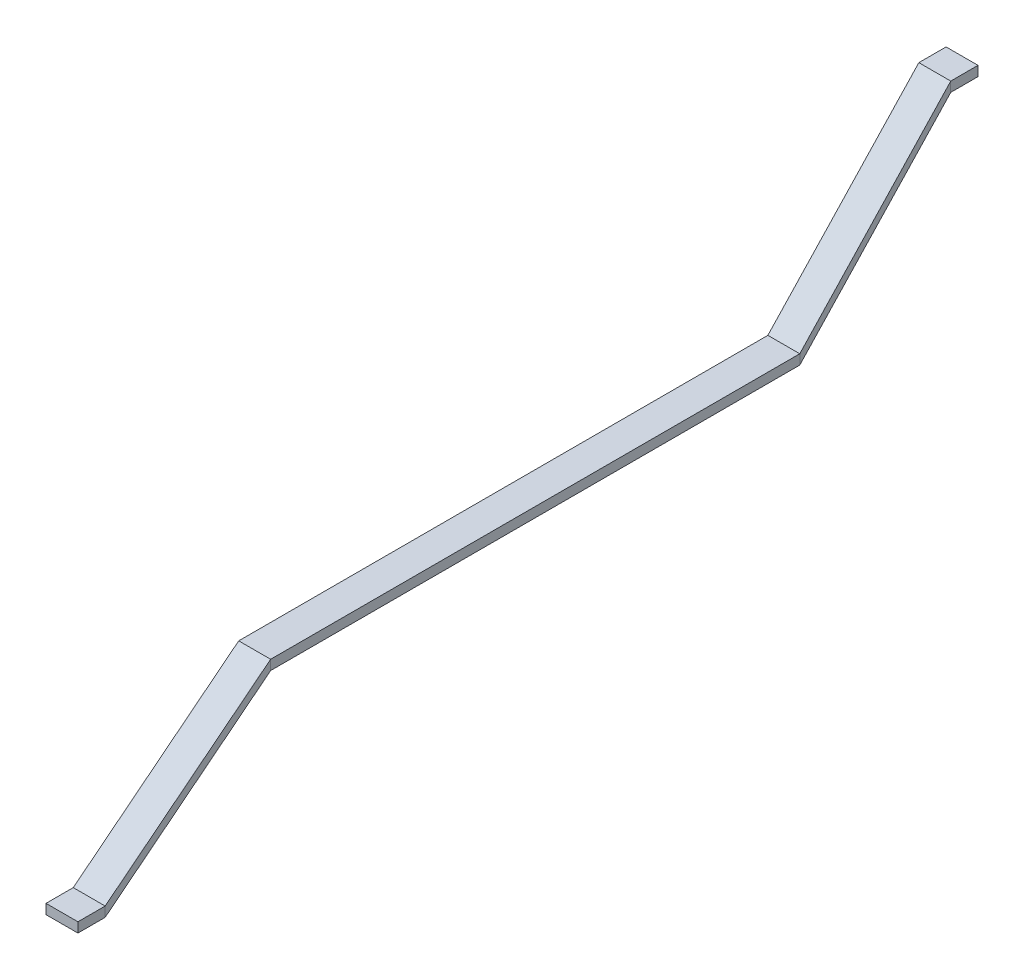
ISO-10303-21;
HEADER;
FILE_DESCRIPTION(('STEP AP214'),'2;1');
FILE_NAME('part.step','',(''),(''),'','','');
FILE_SCHEMA(('AUTOMOTIVE_DESIGN { 1 0 10303 214 1 1 1 1 }'));
ENDSEC;
DATA;
#1=APPLICATION_CONTEXT('core data for automotive mechanical design processes');
#2=APPLICATION_PROTOCOL_DEFINITION('international standard','automotive_design',2000,#1);
#3=PRODUCT_CONTEXT('',#1,'mechanical');
#4=PRODUCT('Part','Part','',(#3));
#5=PRODUCT_RELATED_PRODUCT_CATEGORY('part','',(#4));
#6=PRODUCT_DEFINITION_FORMATION('','',#4);
#7=PRODUCT_DEFINITION_CONTEXT('part definition',#1,'design');
#8=PRODUCT_DEFINITION('design','',#6,#7);
#9=PRODUCT_DEFINITION_SHAPE('','',#8);
#10=(LENGTH_UNIT() NAMED_UNIT(*) SI_UNIT(.MILLI.,.METRE.));
#11=(NAMED_UNIT(*) PLANE_ANGLE_UNIT() SI_UNIT($,.RADIAN.));
#12=(NAMED_UNIT(*) SI_UNIT($,.STERADIAN.) SOLID_ANGLE_UNIT());
#13=UNCERTAINTY_MEASURE_WITH_UNIT(LENGTH_MEASURE(1.E-05),#10,'distance_accuracy_value','');
#14=(GEOMETRIC_REPRESENTATION_CONTEXT(3) GLOBAL_UNCERTAINTY_ASSIGNED_CONTEXT((#13)) GLOBAL_UNIT_ASSIGNED_CONTEXT((#10,
#11,#12)) REPRESENTATION_CONTEXT('',''));
#15=CARTESIAN_POINT('',(0.,0.,0.));
#16=DIRECTION('',(0.,0.,1.));
#17=DIRECTION('',(1.,0.,0.));
#18=AXIS2_PLACEMENT_3D('',#15,#16,#17);
#19=CARTESIAN_POINT('',(0.,0.,-410.));
#20=DIRECTION('',(0.,0.,1.));
#21=DIRECTION('',(1.,0.,0.));
#22=AXIS2_PLACEMENT_3D('',#19,#20,#21);
#23=PLANE('',#22);
#24=DIRECTION('',(0.,-1.,0.));
#25=VECTOR('',#24,1.);
#26=CARTESIAN_POINT('',(3162.93419588837,346.929566118212,-410.));
#27=LINE('',#26,#25);
#28=CARTESIAN_POINT('',(3162.93419588837,346.929566118212,-410.));
#29=VERTEX_POINT('',#28);
#30=CARTESIAN_POINT('',(3162.93419588837,325.329566118212,-410.));
#31=VERTEX_POINT('',#30);
#32=EDGE_CURVE('E128',#29,#31,#27,.T.);
#33=ORIENTED_EDGE('',*,*,#32,.F.);
#34=DIRECTION('',(-1.,0.,0.));
#35=VECTOR('',#34,1.);
#36=CARTESIAN_POINT('',(3162.93419588837,346.929566118212,-410.));
#37=LINE('',#36,#35);
#38=CARTESIAN_POINT('',(3233.18419588837,346.929566118212,-410.));
#39=VERTEX_POINT('',#38);
#40=EDGE_CURVE('E40',#39,#29,#37,.T.);
#41=ORIENTED_EDGE('',*,*,#40,.F.);
#42=DIRECTION('',(0.,1.,0.));
#43=VECTOR('',#42,1.);
#44=CARTESIAN_POINT('',(3233.18419588837,346.929566118212,-410.));
#45=LINE('',#44,#43);
#46=CARTESIAN_POINT('',(3233.18419588837,325.329566118212,-410.));
#47=VERTEX_POINT('',#46);
#48=EDGE_CURVE('E117',#47,#39,#45,.T.);
#49=ORIENTED_EDGE('',*,*,#48,.F.);
#50=DIRECTION('',(1.,0.,0.));
#51=VECTOR('',#50,1.);
#52=CARTESIAN_POINT('',(3162.93419588837,325.329566118212,-410.));
#53=LINE('',#52,#51);
#54=EDGE_CURVE('E111',#31,#47,#53,.T.);
#55=ORIENTED_EDGE('',*,*,#54,.F.);
#56=EDGE_LOOP('',(#33,#41,#49,#55));
#57=FACE_BOUND('',#56,.T.);
#58=ADVANCED_FACE('F37',(#57),#23,.F.);
#59=CARTESIAN_POINT('',(3.34452463663659,-638.751316548725,1575.));
#60=DIRECTION('',(0.,0.,1.));
#61=DIRECTION('',(1.,0.,0.));
#62=AXIS2_PLACEMENT_3D('',#59,#60,#61);
#63=PLANE('',#62);
#64=DIRECTION('',(0.,-1.,0.));
#65=VECTOR('',#64,1.);
#66=CARTESIAN_POINT('',(3166.27872052501,-291.821750430513,1575.));
#67=LINE('',#66,#65);
#68=CARTESIAN_POINT('',(3166.27872052501,-291.821750430513,1575.));
#69=VERTEX_POINT('',#68);
#70=CARTESIAN_POINT('',(3166.27872052501,-313.421750430513,1575.));
#71=VERTEX_POINT('',#70);
#72=EDGE_CURVE('E184',#69,#71,#67,.T.);
#73=ORIENTED_EDGE('',*,*,#72,.T.);
#74=DIRECTION('',(1.,0.,0.));
#75=VECTOR('',#74,1.);
#76=CARTESIAN_POINT('',(3166.27872052501,-313.421750430513,1575.));
#77=LINE('',#76,#75);
#78=CARTESIAN_POINT('',(3236.52872052501,-313.421750430513,1575.));
#79=VERTEX_POINT('',#78);
#80=EDGE_CURVE('E213',#71,#79,#77,.T.);
#81=ORIENTED_EDGE('',*,*,#80,.T.);
#82=DIRECTION('',(0.,1.,0.));
#83=VECTOR('',#82,1.);
#84=CARTESIAN_POINT('',(3236.52872052501,-291.821750430513,1575.));
#85=LINE('',#84,#83);
#86=CARTESIAN_POINT('',(3236.52872052501,-291.821750430513,1575.));
#87=VERTEX_POINT('',#86);
#88=EDGE_CURVE('E206',#79,#87,#85,.T.);
#89=ORIENTED_EDGE('',*,*,#88,.T.);
#90=DIRECTION('',(-1.,0.,0.));
#91=VECTOR('',#90,1.);
#92=CARTESIAN_POINT('',(3166.27872052501,-291.821750430513,1575.));
#93=LINE('',#92,#91);
#94=EDGE_CURVE('E202',#87,#69,#93,.T.);
#95=ORIENTED_EDGE('',*,*,#94,.T.);
#96=EDGE_LOOP('',(#73,#81,#89,#95));
#97=FACE_BOUND('',#96,.T.);
#98=ADVANCED_FACE('F232',(#97),#63,.T.);
#99=CARTESIAN_POINT('',(3162.93419588837,346.929566118212,-350.));
#100=DIRECTION('',(1.,0.,0.));
#101=DIRECTION('',(0.,0.,-1.));
#102=AXIS2_PLACEMENT_3D('',#99,#100,#101);
#103=PLANE('',#102);
#104=DIRECTION('',(0.,0.,-1.));
#105=VECTOR('',#104,1.);
#106=CARTESIAN_POINT('',(3162.93419588837,325.329566118212,-350.));
#107=LINE('',#106,#105);
#108=CARTESIAN_POINT('',(3162.93419588837,325.329566118212,-350.));
#109=VERTEX_POINT('',#108);
#110=EDGE_CURVE('E139',#109,#31,#107,.T.);
#111=ORIENTED_EDGE('',*,*,#110,.F.);
#112=DIRECTION('',(0.,-1.,0.));
#113=VECTOR('',#112,1.);
#114=CARTESIAN_POINT('',(3162.93419588837,346.929566118212,-350.));
#115=LINE('',#114,#113);
#116=CARTESIAN_POINT('',(3162.93419588837,346.929566118212,-350.));
#117=VERTEX_POINT('',#116);
#118=EDGE_CURVE('E158',#117,#109,#115,.T.);
#119=ORIENTED_EDGE('',*,*,#118,.F.);
#120=DIRECTION('',(0.,0.,-1.));
#121=VECTOR('',#120,1.);
#122=CARTESIAN_POINT('',(3162.93419588837,346.929566118212,-350.));
#123=LINE('',#122,#121);
#124=EDGE_CURVE('E140',#117,#29,#123,.T.);
#125=ORIENTED_EDGE('',*,*,#124,.T.);
#126=ORIENTED_EDGE('',*,*,#32,.T.);
#127=EDGE_LOOP('',(#111,#119,#125,#126));
#128=FACE_BOUND('',#127,.T.);
#129=ADVANCED_FACE('F313',(#128),#103,.F.);
#130=CARTESIAN_POINT('',(3162.93419588837,325.329566118212,-350.));
#131=DIRECTION('',(0.,1.,0.));
#132=DIRECTION('',(0.,0.,1.));
#133=AXIS2_PLACEMENT_3D('',#130,#131,#132);
#134=PLANE('',#133);
#135=DIRECTION('',(0.,0.,-1.));
#136=VECTOR('',#135,1.);
#137=CARTESIAN_POINT('',(3233.18419588837,325.329566118212,-350.));
#138=LINE('',#137,#136);
#139=CARTESIAN_POINT('',(3233.18419588837,325.329566118212,-350.));
#140=VERTEX_POINT('',#139);
#141=EDGE_CURVE('E124',#140,#47,#138,.T.);
#142=ORIENTED_EDGE('',*,*,#141,.F.);
#143=DIRECTION('',(1.,0.,0.));
#144=VECTOR('',#143,1.);
#145=CARTESIAN_POINT('',(3162.93419588837,325.329566118212,-350.));
#146=LINE('',#145,#144);
#147=EDGE_CURVE('E153',#109,#140,#146,.T.);
#148=ORIENTED_EDGE('',*,*,#147,.F.);
#149=ORIENTED_EDGE('',*,*,#110,.T.);
#150=ORIENTED_EDGE('',*,*,#54,.T.);
#151=EDGE_LOOP('',(#142,#148,#149,#150));
#152=FACE_BOUND('',#151,.T.);
#153=ADVANCED_FACE('F316',(#152),#134,.F.);
#154=CARTESIAN_POINT('',(3233.18419588837,346.929566118212,-350.));
#155=DIRECTION('',(-1.,0.,0.));
#156=DIRECTION('',(0.,0.,1.));
#157=AXIS2_PLACEMENT_3D('',#154,#155,#156);
#158=PLANE('',#157);
#159=DIRECTION('',(0.,0.,-1.));
#160=VECTOR('',#159,1.);
#161=CARTESIAN_POINT('',(3233.18419588837,346.929566118212,-350.));
#162=LINE('',#161,#160);
#163=CARTESIAN_POINT('',(3233.18419588837,346.929566118212,-350.));
#164=VERTEX_POINT('',#163);
#165=EDGE_CURVE('E122',#164,#39,#162,.T.);
#166=ORIENTED_EDGE('',*,*,#165,.F.);
#167=DIRECTION('',(0.,1.,0.));
#168=VECTOR('',#167,1.);
#169=CARTESIAN_POINT('',(3233.18419588837,346.929566118212,-350.));
#170=LINE('',#169,#168);
#171=EDGE_CURVE('E148',#140,#164,#170,.T.);
#172=ORIENTED_EDGE('',*,*,#171,.F.);
#173=ORIENTED_EDGE('',*,*,#141,.T.);
#174=ORIENTED_EDGE('',*,*,#48,.T.);
#175=EDGE_LOOP('',(#166,#172,#173,#174));
#176=FACE_BOUND('',#175,.T.);
#177=ADVANCED_FACE('F119',(#176),#158,.F.);
#178=CARTESIAN_POINT('',(3162.93419588837,346.929566118212,-350.));
#179=DIRECTION('',(0.,-1.,0.));
#180=DIRECTION('',(0.,0.,-1.));
#181=AXIS2_PLACEMENT_3D('',#178,#179,#180);
#182=PLANE('',#181);
#183=ORIENTED_EDGE('',*,*,#40,.T.);
#184=ORIENTED_EDGE('',*,*,#124,.F.);
#185=DIRECTION('',(-1.,0.,0.));
#186=VECTOR('',#185,1.);
#187=CARTESIAN_POINT('',(3162.93419588837,346.929566118212,-350.));
#188=LINE('',#187,#186);
#189=EDGE_CURVE('E134',#164,#117,#188,.T.);
#190=ORIENTED_EDGE('',*,*,#189,.F.);
#191=ORIENTED_EDGE('',*,*,#165,.T.);
#192=EDGE_LOOP('',(#183,#184,#190,#191));
#193=FACE_BOUND('',#192,.T.);
#194=ADVANCED_FACE('F133',(#193),#182,.F.);
#195=CARTESIAN_POINT('',(3180.55,10.7999999999999,4.9960036108132E-13));
#196=DIRECTION('',(0.998735803156119,0.,-0.0502672407647662));
#197=DIRECTION('',(-0.0502672407647662,0.,-0.998735803156119));
#198=AXIS2_PLACEMENT_3D('',#195,#196,#197);
#199=PLANE('',#198);
#200=DIRECTION('',(-0.0362774413178976,0.692214816467807,-0.72077915835148));
#201=VECTOR('',#200,1.);
#202=CARTESIAN_POINT('',(3180.55,-10.8,4.9960036108132E-13));
#203=LINE('',#202,#201);
#204=CARTESIAN_POINT('',(3180.55,-10.8,4.71844785465692E-13));
#205=VERTEX_POINT('',#204);
#206=EDGE_CURVE('E155',#205,#109,#203,.T.);
#207=ORIENTED_EDGE('',*,*,#206,.F.);
#208=DIRECTION('',(0.,-1.,0.));
#209=VECTOR('',#208,1.);
#210=CARTESIAN_POINT('',(3180.55,10.7999999999999,4.9960036108132E-13));
#211=LINE('',#210,#209);
#212=CARTESIAN_POINT('',(3180.55,10.7999999999999,4.71844785465692E-13));
#213=VERTEX_POINT('',#212);
#214=EDGE_CURVE('E178',#213,#205,#211,.T.);
#215=ORIENTED_EDGE('',*,*,#214,.F.);
#216=DIRECTION('',(-0.0362774413178976,0.692214816467807,-0.72077915835148));
#217=VECTOR('',#216,1.);
#218=CARTESIAN_POINT('',(3180.55,10.7999999999999,4.9960036108132E-13));
#219=LINE('',#218,#217);
#220=EDGE_CURVE('E132',#213,#117,#219,.T.);
#221=ORIENTED_EDGE('',*,*,#220,.T.);
#222=ORIENTED_EDGE('',*,*,#118,.T.);
#223=EDGE_LOOP('',(#207,#215,#221,#222));
#224=FACE_BOUND('',#223,.T.);
#225=ADVANCED_FACE('F298',(#224),#199,.F.);
#226=CARTESIAN_POINT('',(3180.55,-10.8,4.9960036108132E-13));
#227=DIRECTION('',(0.,0.72125391870639,0.692670762159539));
#228=DIRECTION('',(0.,-0.692670762159539,0.72125391870639));
#229=AXIS2_PLACEMENT_3D('',#226,#227,#228);
#230=PLANE('',#229);
#231=DIRECTION('',(-0.0362774413178976,0.692214816467807,-0.72077915835148));
#232=VECTOR('',#231,1.);
#233=CARTESIAN_POINT('',(3250.8,-10.8,4.9960036108132E-13));
#234=LINE('',#233,#232);
#235=CARTESIAN_POINT('',(3250.8,-10.8,4.71844785465692E-13));
#236=VERTEX_POINT('',#235);
#237=EDGE_CURVE('E150',#236,#140,#234,.T.);
#238=ORIENTED_EDGE('',*,*,#237,.F.);
#239=DIRECTION('',(1.,0.,0.));
#240=VECTOR('',#239,1.);
#241=CARTESIAN_POINT('',(3180.55,-10.8,4.9960036108132E-13));
#242=LINE('',#241,#240);
#243=EDGE_CURVE('E173',#205,#236,#242,.T.);
#244=ORIENTED_EDGE('',*,*,#243,.F.);
#245=ORIENTED_EDGE('',*,*,#206,.T.);
#246=ORIENTED_EDGE('',*,*,#147,.T.);
#247=EDGE_LOOP('',(#238,#244,#245,#246));
#248=FACE_BOUND('',#247,.T.);
#249=ADVANCED_FACE('F301',(#248),#230,.F.);
#250=CARTESIAN_POINT('',(3250.8,10.7999999999999,4.9960036108132E-13));
#251=DIRECTION('',(-0.998735803156119,0.,0.0502672407647662));
#252=DIRECTION('',(0.0502672407647662,0.,0.998735803156119));
#253=AXIS2_PLACEMENT_3D('',#250,#251,#252);
#254=PLANE('',#253);
#255=DIRECTION('',(-0.0362774413178976,0.692214816467807,-0.72077915835148));
#256=VECTOR('',#255,1.);
#257=CARTESIAN_POINT('',(3250.8,10.7999999999999,4.9960036108132E-13));
#258=LINE('',#257,#256);
#259=CARTESIAN_POINT('',(3250.8,10.7999999999999,4.71844785465692E-13));
#260=VERTEX_POINT('',#259);
#261=EDGE_CURVE('E146',#260,#164,#258,.T.);
#262=ORIENTED_EDGE('',*,*,#261,.F.);
#263=DIRECTION('',(0.,1.,0.));
#264=VECTOR('',#263,1.);
#265=CARTESIAN_POINT('',(3250.8,10.7999999999999,4.9960036108132E-13));
#266=LINE('',#265,#264);
#267=EDGE_CURVE('E168',#236,#260,#266,.T.);
#268=ORIENTED_EDGE('',*,*,#267,.F.);
#269=ORIENTED_EDGE('',*,*,#237,.T.);
#270=ORIENTED_EDGE('',*,*,#171,.T.);
#271=EDGE_LOOP('',(#262,#268,#269,#270));
#272=FACE_BOUND('',#271,.T.);
#273=ADVANCED_FACE('F305',(#272),#254,.F.);
#274=CARTESIAN_POINT('',(3180.55,10.7999999999999,4.9960036108132E-13));
#275=DIRECTION('',(0.,-0.72125391870639,-0.692670762159539));
#276=DIRECTION('',(0.,0.692670762159539,-0.72125391870639));
#277=AXIS2_PLACEMENT_3D('',#274,#275,#276);
#278=PLANE('',#277);
#279=ORIENTED_EDGE('',*,*,#189,.T.);
#280=ORIENTED_EDGE('',*,*,#220,.F.);
#281=DIRECTION('',(-1.,0.,0.));
#282=VECTOR('',#281,1.);
#283=CARTESIAN_POINT('',(3180.55,10.7999999999999,4.9960036108132E-13));
#284=LINE('',#283,#282);
#285=EDGE_CURVE('E162',#260,#213,#284,.T.);
#286=ORIENTED_EDGE('',*,*,#285,.F.);
#287=ORIENTED_EDGE('',*,*,#261,.T.);
#288=EDGE_LOOP('',(#279,#280,#286,#287));
#289=FACE_BOUND('',#288,.T.);
#290=ADVANCED_FACE('F286',(#289),#278,.F.);
#291=CARTESIAN_POINT('',(3180.55,10.7999999999999,1165.));
#292=DIRECTION('',(1.,0.,0.));
#293=DIRECTION('',(0.,0.,-1.));
#294=AXIS2_PLACEMENT_3D('',#291,#292,#293);
#295=PLANE('',#294);
#296=DIRECTION('',(0.,0.,-1.));
#297=VECTOR('',#296,1.);
#298=CARTESIAN_POINT('',(3180.55,-10.8,1165.));
#299=LINE('',#298,#297);
#300=CARTESIAN_POINT('',(3180.55,-10.8000000000001,1165.));
#301=VERTEX_POINT('',#300);
#302=EDGE_CURVE('E175',#301,#205,#299,.T.);
#303=ORIENTED_EDGE('',*,*,#302,.F.);
#304=DIRECTION('',(0.,-1.,0.));
#305=VECTOR('',#304,1.);
#306=CARTESIAN_POINT('',(3180.55,10.7999999999999,1165.));
#307=LINE('',#306,#305);
#308=CARTESIAN_POINT('',(3180.55,10.7999999999999,1165.));
#309=VERTEX_POINT('',#308);
#310=EDGE_CURVE('E198',#309,#301,#307,.T.);
#311=ORIENTED_EDGE('',*,*,#310,.F.);
#312=DIRECTION('',(0.,0.,-1.));
#313=VECTOR('',#312,1.);
#314=CARTESIAN_POINT('',(3180.55,10.7999999999999,1165.));
#315=LINE('',#314,#313);
#316=EDGE_CURVE('E145',#309,#213,#315,.T.);
#317=ORIENTED_EDGE('',*,*,#316,.T.);
#318=ORIENTED_EDGE('',*,*,#214,.T.);
#319=EDGE_LOOP('',(#303,#311,#317,#318));
#320=FACE_BOUND('',#319,.T.);
#321=ADVANCED_FACE('F282',(#320),#295,.F.);
#322=CARTESIAN_POINT('',(3180.55,-10.8,1165.));
#323=DIRECTION('',(0.,1.,0.));
#324=DIRECTION('',(0.,0.,1.));
#325=AXIS2_PLACEMENT_3D('',#322,#323,#324);
#326=PLANE('',#325);
#327=DIRECTION('',(0.,0.,-1.));
#328=VECTOR('',#327,1.);
#329=CARTESIAN_POINT('',(3250.8,-10.8,1165.));
#330=LINE('',#329,#328);
#331=CARTESIAN_POINT('',(3250.8,-10.8000000000001,1165.));
#332=VERTEX_POINT('',#331);
#333=EDGE_CURVE('E170',#332,#236,#330,.T.);
#334=ORIENTED_EDGE('',*,*,#333,.F.);
#335=DIRECTION('',(1.,0.,0.));
#336=VECTOR('',#335,1.);
#337=CARTESIAN_POINT('',(3180.55,-10.8,1165.));
#338=LINE('',#337,#336);
#339=EDGE_CURVE('E193',#301,#332,#338,.T.);
#340=ORIENTED_EDGE('',*,*,#339,.F.);
#341=ORIENTED_EDGE('',*,*,#302,.T.);
#342=ORIENTED_EDGE('',*,*,#243,.T.);
#343=EDGE_LOOP('',(#334,#340,#341,#342));
#344=FACE_BOUND('',#343,.T.);
#345=ADVANCED_FACE('F285',(#344),#326,.F.);
#346=CARTESIAN_POINT('',(3250.8,10.7999999999999,1165.));
#347=DIRECTION('',(-1.,0.,0.));
#348=DIRECTION('',(0.,0.,1.));
#349=AXIS2_PLACEMENT_3D('',#346,#347,#348);
#350=PLANE('',#349);
#351=DIRECTION('',(0.,0.,-1.));
#352=VECTOR('',#351,1.);
#353=CARTESIAN_POINT('',(3250.8,10.7999999999999,1165.));
#354=LINE('',#353,#352);
#355=CARTESIAN_POINT('',(3250.8,10.7999999999999,1165.));
#356=VERTEX_POINT('',#355);
#357=EDGE_CURVE('E165',#356,#260,#354,.T.);
#358=ORIENTED_EDGE('',*,*,#357,.F.);
#359=DIRECTION('',(0.,1.,0.));
#360=VECTOR('',#359,1.);
#361=CARTESIAN_POINT('',(3250.8,10.7999999999999,1165.));
#362=LINE('',#361,#360);
#363=EDGE_CURVE('E188',#332,#356,#362,.T.);
#364=ORIENTED_EDGE('',*,*,#363,.F.);
#365=ORIENTED_EDGE('',*,*,#333,.T.);
#366=ORIENTED_EDGE('',*,*,#267,.T.);
#367=EDGE_LOOP('',(#358,#364,#365,#366));
#368=FACE_BOUND('',#367,.T.);
#369=ADVANCED_FACE('F290',(#368),#350,.F.);
#370=CARTESIAN_POINT('',(3180.55,10.7999999999999,1165.));
#371=DIRECTION('',(0.,-1.,0.));
#372=DIRECTION('',(0.,0.,-1.));
#373=AXIS2_PLACEMENT_3D('',#370,#371,#372);
#374=PLANE('',#373);
#375=ORIENTED_EDGE('',*,*,#285,.T.);
#376=ORIENTED_EDGE('',*,*,#316,.F.);
#377=DIRECTION('',(-1.,0.,0.));
#378=VECTOR('',#377,1.);
#379=CARTESIAN_POINT('',(3180.55,10.7999999999999,1165.));
#380=LINE('',#379,#378);
#381=EDGE_CURVE('E182',#356,#309,#380,.T.);
#382=ORIENTED_EDGE('',*,*,#381,.F.);
#383=ORIENTED_EDGE('',*,*,#357,.T.);
#384=EDGE_LOOP('',(#375,#376,#382,#383));
#385=FACE_BOUND('',#384,.T.);
#386=ADVANCED_FACE('F269',(#385),#374,.F.);
#387=CARTESIAN_POINT('',(3166.27872052501,-291.821750430513,1515.));
#388=DIRECTION('',(0.99916973141841,0.,0.040741229942928));
#389=DIRECTION('',(0.040741229942928,0.,-0.99916973141841));
#390=AXIS2_PLACEMENT_3D('',#387,#388,#389);
#391=PLANE('',#390);
#392=DIRECTION('',(0.0308296398160387,0.65374093350359,-0.756090156774089));
#393=VECTOR('',#392,1.);
#394=CARTESIAN_POINT('',(3166.27872052501,-313.421750430513,1515.));
#395=LINE('',#394,#393);
#396=CARTESIAN_POINT('',(3166.27872052501,-313.421750430513,1515.));
#397=VERTEX_POINT('',#396);
#398=EDGE_CURVE('E195',#397,#301,#395,.T.);
#399=ORIENTED_EDGE('',*,*,#398,.F.);
#400=DIRECTION('',(0.,-1.,0.));
#401=VECTOR('',#400,1.);
#402=CARTESIAN_POINT('',(3166.27872052501,-291.821750430513,1515.));
#403=LINE('',#402,#401);
#404=CARTESIAN_POINT('',(3166.27872052501,-291.821750430513,1515.));
#405=VERTEX_POINT('',#404);
#406=EDGE_CURVE('E222',#405,#397,#403,.T.);
#407=ORIENTED_EDGE('',*,*,#406,.F.);
#408=DIRECTION('',(0.0308296398160387,0.65374093350359,-0.756090156774089));
#409=VECTOR('',#408,1.);
#410=CARTESIAN_POINT('',(3166.27872052501,-291.821750430513,1515.));
#411=LINE('',#410,#409);
#412=EDGE_CURVE('E164',#405,#309,#411,.T.);
#413=ORIENTED_EDGE('',*,*,#412,.T.);
#414=ORIENTED_EDGE('',*,*,#310,.T.);
#415=EDGE_LOOP('',(#399,#407,#413,#414));
#416=FACE_BOUND('',#415,.T.);
#417=ADVANCED_FACE('F265',(#416),#391,.F.);
#418=CARTESIAN_POINT('',(3166.27872052501,-313.421750430513,1515.));
#419=DIRECTION('',(0.,0.756449732372647,0.654051834638012));
#420=DIRECTION('',(0.,-0.654051834638013,0.756449732372648));
#421=AXIS2_PLACEMENT_3D('',#418,#419,#420);
#422=PLANE('',#421);
#423=DIRECTION('',(0.0308296398160387,0.65374093350359,-0.756090156774089));
#424=VECTOR('',#423,1.);
#425=CARTESIAN_POINT('',(3236.52872052501,-313.421750430513,1515.));
#426=LINE('',#425,#424);
#427=CARTESIAN_POINT('',(3236.52872052501,-313.421750430513,1515.));
#428=VERTEX_POINT('',#427);
#429=EDGE_CURVE('E190',#428,#332,#426,.T.);
#430=ORIENTED_EDGE('',*,*,#429,.F.);
#431=DIRECTION('',(1.,0.,0.));
#432=VECTOR('',#431,1.);
#433=CARTESIAN_POINT('',(3166.27872052501,-313.421750430513,1515.));
#434=LINE('',#433,#432);
#435=EDGE_CURVE('E215',#397,#428,#434,.T.);
#436=ORIENTED_EDGE('',*,*,#435,.F.);
#437=ORIENTED_EDGE('',*,*,#398,.T.);
#438=ORIENTED_EDGE('',*,*,#339,.T.);
#439=EDGE_LOOP('',(#430,#436,#437,#438));
#440=FACE_BOUND('',#439,.T.);
#441=ADVANCED_FACE('F268',(#440),#422,.F.);
#442=CARTESIAN_POINT('',(3236.52872052501,-291.821750430513,1515.));
#443=DIRECTION('',(-0.99916973141841,0.,-0.040741229942928));
#444=DIRECTION('',(-0.040741229942928,0.,0.99916973141841));
#445=AXIS2_PLACEMENT_3D('',#442,#443,#444);
#446=PLANE('',#445);
#447=DIRECTION('',(0.0308296398160387,0.65374093350359,-0.756090156774089));
#448=VECTOR('',#447,1.);
#449=CARTESIAN_POINT('',(3236.52872052501,-291.821750430513,1515.));
#450=LINE('',#449,#448);
#451=CARTESIAN_POINT('',(3236.52872052501,-291.821750430513,1515.));
#452=VERTEX_POINT('',#451);
#453=EDGE_CURVE('E185',#452,#356,#450,.T.);
#454=ORIENTED_EDGE('',*,*,#453,.F.);
#455=DIRECTION('',(0.,1.,0.));
#456=VECTOR('',#455,1.);
#457=CARTESIAN_POINT('',(3236.52872052501,-291.821750430513,1515.));
#458=LINE('',#457,#456);
#459=EDGE_CURVE('E55',#428,#452,#458,.T.);
#460=ORIENTED_EDGE('',*,*,#459,.F.);
#461=ORIENTED_EDGE('',*,*,#429,.T.);
#462=ORIENTED_EDGE('',*,*,#363,.T.);
#463=EDGE_LOOP('',(#454,#460,#461,#462));
#464=FACE_BOUND('',#463,.T.);
#465=ADVANCED_FACE('F273',(#464),#446,.F.);
#466=CARTESIAN_POINT('',(3166.27872052501,-291.821750430513,1515.));
#467=DIRECTION('',(0.,-0.756449732372647,-0.654051834638012));
#468=DIRECTION('',(0.,0.654051834638013,-0.756449732372648));
#469=AXIS2_PLACEMENT_3D('',#466,#467,#468);
#470=PLANE('',#469);
#471=ORIENTED_EDGE('',*,*,#381,.T.);
#472=ORIENTED_EDGE('',*,*,#412,.F.);
#473=DIRECTION('',(-1.,0.,0.));
#474=VECTOR('',#473,1.);
#475=CARTESIAN_POINT('',(3166.27872052501,-291.821750430513,1515.));
#476=LINE('',#475,#474);
#477=EDGE_CURVE('E11',#452,#405,#476,.T.);
#478=ORIENTED_EDGE('',*,*,#477,.F.);
#479=ORIENTED_EDGE('',*,*,#453,.T.);
#480=EDGE_LOOP('',(#471,#472,#478,#479));
#481=FACE_BOUND('',#480,.T.);
#482=ADVANCED_FACE('F277',(#481),#470,.F.);
#483=CARTESIAN_POINT('',(3166.27872052501,-291.821750430513,1575.));
#484=DIRECTION('',(1.,0.,0.));
#485=DIRECTION('',(0.,0.,-1.));
#486=AXIS2_PLACEMENT_3D('',#483,#484,#485);
#487=PLANE('',#486);
#488=DIRECTION('',(0.,0.,-1.));
#489=VECTOR('',#488,1.);
#490=CARTESIAN_POINT('',(3166.27872052501,-313.421750430513,1575.));
#491=LINE('',#490,#489);
#492=EDGE_CURVE('E217',#71,#397,#491,.T.);
#493=ORIENTED_EDGE('',*,*,#492,.F.);
#494=ORIENTED_EDGE('',*,*,#72,.F.);
#495=DIRECTION('',(0.,0.,-1.));
#496=VECTOR('',#495,1.);
#497=CARTESIAN_POINT('',(3166.27872052501,-291.821750430513,1575.));
#498=LINE('',#497,#496);
#499=EDGE_CURVE('E205',#69,#405,#498,.T.);
#500=ORIENTED_EDGE('',*,*,#499,.T.);
#501=ORIENTED_EDGE('',*,*,#406,.T.);
#502=EDGE_LOOP('',(#493,#494,#500,#501));
#503=FACE_BOUND('',#502,.T.);
#504=ADVANCED_FACE('F240',(#503),#487,.F.);
#505=CARTESIAN_POINT('',(3166.27872052501,-313.421750430513,1575.));
#506=DIRECTION('',(0.,1.,0.));
#507=DIRECTION('',(0.,0.,1.));
#508=AXIS2_PLACEMENT_3D('',#505,#506,#507);
#509=PLANE('',#508);
#510=DIRECTION('',(0.,0.,-1.));
#511=VECTOR('',#510,1.);
#512=CARTESIAN_POINT('',(3236.52872052501,-313.421750430513,1575.));
#513=LINE('',#512,#511);
#514=EDGE_CURVE('E210',#79,#428,#513,.T.);
#515=ORIENTED_EDGE('',*,*,#514,.F.);
#516=ORIENTED_EDGE('',*,*,#80,.F.);
#517=ORIENTED_EDGE('',*,*,#492,.T.);
#518=ORIENTED_EDGE('',*,*,#435,.T.);
#519=EDGE_LOOP('',(#515,#516,#517,#518));
#520=FACE_BOUND('',#519,.T.);
#521=ADVANCED_FACE('F244',(#520),#509,.F.);
#522=CARTESIAN_POINT('',(3236.52872052501,-291.821750430513,1575.));
#523=DIRECTION('',(-1.,0.,0.));
#524=DIRECTION('',(0.,0.,1.));
#525=AXIS2_PLACEMENT_3D('',#522,#523,#524);
#526=PLANE('',#525);
#527=DIRECTION('',(0.,0.,-1.));
#528=VECTOR('',#527,1.);
#529=CARTESIAN_POINT('',(3236.52872052501,-291.821750430513,1575.));
#530=LINE('',#529,#528);
#531=EDGE_CURVE('E46',#87,#452,#530,.T.);
#532=ORIENTED_EDGE('',*,*,#531,.F.);
#533=ORIENTED_EDGE('',*,*,#88,.F.);
#534=ORIENTED_EDGE('',*,*,#514,.T.);
#535=ORIENTED_EDGE('',*,*,#459,.T.);
#536=EDGE_LOOP('',(#532,#533,#534,#535));
#537=FACE_BOUND('',#536,.T.);
#538=ADVANCED_FACE('F254',(#537),#526,.F.);
#539=CARTESIAN_POINT('',(3166.27872052501,-291.821750430513,1575.));
#540=DIRECTION('',(0.,-1.,0.));
#541=DIRECTION('',(0.,0.,-1.));
#542=AXIS2_PLACEMENT_3D('',#539,#540,#541);
#543=PLANE('',#542);
#544=ORIENTED_EDGE('',*,*,#477,.T.);
#545=ORIENTED_EDGE('',*,*,#499,.F.);
#546=ORIENTED_EDGE('',*,*,#94,.F.);
#547=ORIENTED_EDGE('',*,*,#531,.T.);
#548=EDGE_LOOP('',(#544,#545,#546,#547));
#549=FACE_BOUND('',#548,.T.);
#550=ADVANCED_FACE('F253',(#549),#543,.F.);
#551=CLOSED_SHELL('',(#58,#98,#129,#153,#177,#194,#225,#249,#273,#290,#321,#345,#369,#386,#417,
#441,#465,#482,#504,#521,#538,#550));
#552=MANIFOLD_SOLID_BREP('B2',#551);
#553=ADVANCED_BREP_SHAPE_REPRESENTATION('',(#18,#552),#14);
#554=SHAPE_DEFINITION_REPRESENTATION(#9,#553);
ENDSEC;
END-ISO-10303-21;
